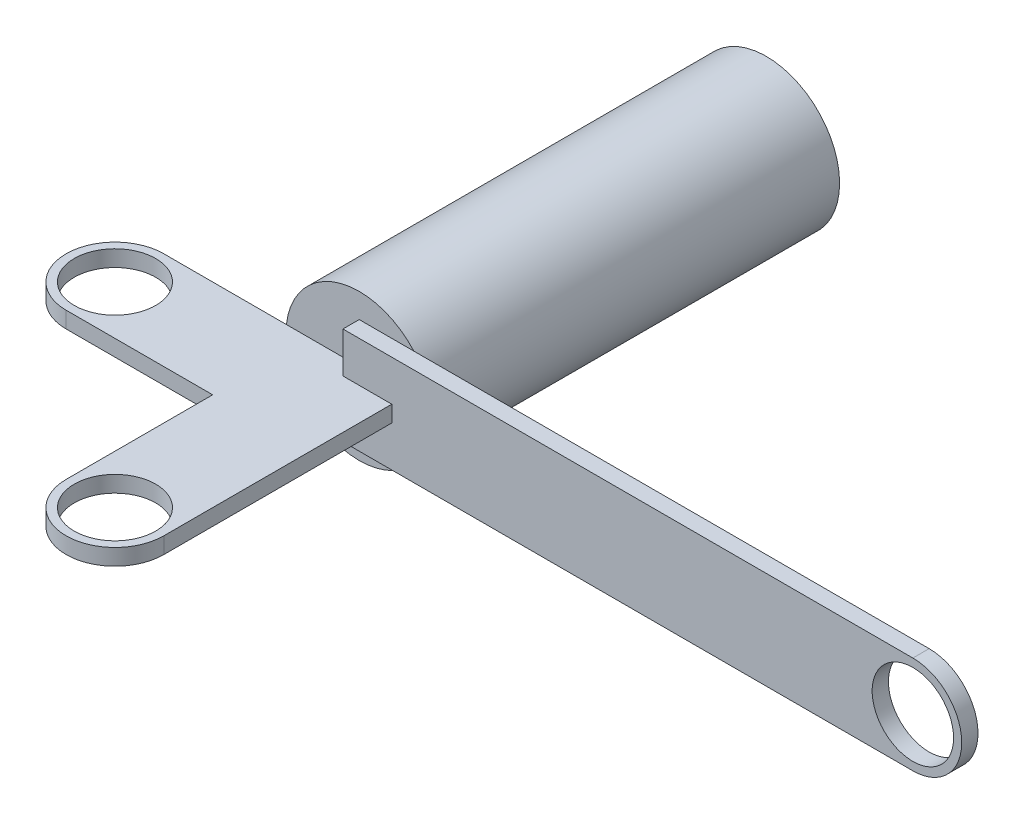
ISO-10303-21;
HEADER;
FILE_DESCRIPTION(('STEP AP214'),'2;1');
FILE_NAME('part.step','',(''),(''),'','','');
FILE_SCHEMA(('AUTOMOTIVE_DESIGN { 1 0 10303 214 1 1 1 1 }'));
ENDSEC;
DATA;
#1=APPLICATION_CONTEXT('core data for automotive mechanical design processes');
#2=APPLICATION_PROTOCOL_DEFINITION('international standard','automotive_design',2000,#1);
#3=PRODUCT_CONTEXT('',#1,'mechanical');
#4=PRODUCT('Part','Part','',(#3));
#5=PRODUCT_RELATED_PRODUCT_CATEGORY('part','',(#4));
#6=PRODUCT_DEFINITION_FORMATION('','',#4);
#7=PRODUCT_DEFINITION_CONTEXT('part definition',#1,'design');
#8=PRODUCT_DEFINITION('design','',#6,#7);
#9=PRODUCT_DEFINITION_SHAPE('','',#8);
#10=(LENGTH_UNIT() NAMED_UNIT(*) SI_UNIT(.MILLI.,.METRE.));
#11=(NAMED_UNIT(*) PLANE_ANGLE_UNIT() SI_UNIT($,.RADIAN.));
#12=(NAMED_UNIT(*) SI_UNIT($,.STERADIAN.) SOLID_ANGLE_UNIT());
#13=UNCERTAINTY_MEASURE_WITH_UNIT(LENGTH_MEASURE(1.E-05),#10,'distance_accuracy_value','');
#14=(GEOMETRIC_REPRESENTATION_CONTEXT(3) GLOBAL_UNCERTAINTY_ASSIGNED_CONTEXT((#13)) GLOBAL_UNIT_ASSIGNED_CONTEXT((#10,
#11,#12)) REPRESENTATION_CONTEXT('',''));
#15=CARTESIAN_POINT('',(0.,0.,0.));
#16=DIRECTION('',(0.,0.,1.));
#17=DIRECTION('',(1.,0.,0.));
#18=AXIS2_PLACEMENT_3D('',#15,#16,#17);
#19=CARTESIAN_POINT('',(0.,0.,0.));
#20=DIRECTION('',(0.,0.,1.));
#21=DIRECTION('',(1.,0.,0.));
#22=AXIS2_PLACEMENT_3D('',#19,#20,#21);
#23=PLANE('',#22);
#24=CARTESIAN_POINT('',(0.,0.,0.));
#25=DIRECTION('',(0.,0.,1.));
#26=DIRECTION('',(1.,0.,0.));
#27=AXIS2_PLACEMENT_3D('',#24,#25,#26);
#28=CIRCLE('',#27,9.);
#29=CARTESIAN_POINT('',(-8.94427190999916,-1.,0.));
#30=VERTEX_POINT('',#29);
#31=CARTESIAN_POINT('',(6.70820393249937,-6.,0.));
#32=VERTEX_POINT('',#31);
#33=EDGE_CURVE('E240',#30,#32,#28,.T.);
#34=ORIENTED_EDGE('',*,*,#33,.T.);
#35=DIRECTION('',(1.,0.,0.));
#36=VECTOR('',#35,1.);
#37=CARTESIAN_POINT('',(0.,-6.,0.));
#38=LINE('',#37,#36);
#39=CARTESIAN_POINT('',(0.,-6.,0.));
#40=VERTEX_POINT('',#39);
#41=EDGE_CURVE('E52',#40,#32,#38,.T.);
#42=ORIENTED_EDGE('',*,*,#41,.F.);
#43=DIRECTION('',(0.,-1.,0.));
#44=VECTOR('',#43,1.);
#45=CARTESIAN_POINT('',(0.,0.,0.));
#46=LINE('',#45,#44);
#47=CARTESIAN_POINT('',(0.,-1.,0.));
#48=VERTEX_POINT('',#47);
#49=EDGE_CURVE('E163',#48,#40,#46,.T.);
#50=ORIENTED_EDGE('',*,*,#49,.F.);
#51=DIRECTION('',(-1.,0.,0.));
#52=VECTOR('',#51,1.);
#53=CARTESIAN_POINT('',(0.,-1.,0.));
#54=LINE('',#53,#52);
#55=EDGE_CURVE('E236',#48,#30,#54,.T.);
#56=ORIENTED_EDGE('',*,*,#55,.T.);
#57=EDGE_LOOP('',(#34,#42,#50,#56));
#58=FACE_BOUND('',#57,.T.);
#59=ADVANCED_FACE('F37',(#58),#23,.T.);
#60=CARTESIAN_POINT('',(0.,6.,0.));
#61=VERTEX_POINT('',#60);
#62=CARTESIAN_POINT('',(0.,1.,0.));
#63=VERTEX_POINT('',#62);
#64=EDGE_CURVE('E60',#61,#63,#46,.T.);
#65=ORIENTED_EDGE('',*,*,#64,.F.);
#66=DIRECTION('',(-1.,0.,0.));
#67=VECTOR('',#66,1.);
#68=CARTESIAN_POINT('',(0.,6.,0.));
#69=LINE('',#68,#67);
#70=CARTESIAN_POINT('',(6.70820393249937,6.,0.));
#71=VERTEX_POINT('',#70);
#72=EDGE_CURVE('E253',#71,#61,#69,.T.);
#73=ORIENTED_EDGE('',*,*,#72,.F.);
#74=CARTESIAN_POINT('',(-8.94427190999916,1.,0.));
#75=VERTEX_POINT('',#74);
#76=EDGE_CURVE('E232',#71,#75,#28,.T.);
#77=ORIENTED_EDGE('',*,*,#76,.T.);
#78=DIRECTION('',(-1.,0.,0.));
#79=VECTOR('',#78,1.);
#80=CARTESIAN_POINT('',(0.,1.,0.));
#81=LINE('',#80,#79);
#82=EDGE_CURVE('E242',#63,#75,#81,.T.);
#83=ORIENTED_EDGE('',*,*,#82,.F.);
#84=EDGE_LOOP('',(#65,#73,#77,#83));
#85=FACE_BOUND('',#84,.T.);
#86=ADVANCED_FACE('F281',(#85),#23,.T.);
#87=CARTESIAN_POINT('',(0.,0.,-50.));
#88=DIRECTION('',(0.,0.,1.));
#89=DIRECTION('',(1.,0.,0.));
#90=AXIS2_PLACEMENT_3D('',#87,#88,#89);
#91=CYLINDRICAL_SURFACE('',#90,9.);
#92=CARTESIAN_POINT('',(0.,0.,-50.));
#93=DIRECTION('',(0.,0.,1.));
#94=DIRECTION('',(1.,0.,0.));
#95=AXIS2_PLACEMENT_3D('',#92,#93,#94);
#96=CIRCLE('',#95,9.);
#97=CARTESIAN_POINT('',(9.,0.,-50.));
#98=VERTEX_POINT('',#97);
#99=EDGE_CURVE('E233',#98,#98,#96,.T.);
#100=ORIENTED_EDGE('',*,*,#99,.T.);
#101=EDGE_LOOP('',(#100));
#102=FACE_BOUND('',#101,.T.);
#103=EDGE_CURVE('E237',#75,#30,#28,.T.);
#104=ORIENTED_EDGE('',*,*,#103,.F.);
#105=ORIENTED_EDGE('',*,*,#76,.F.);
#106=CARTESIAN_POINT('',(0.,0.,0.));
#107=DIRECTION('',(0.,0.,1.));
#108=DIRECTION('',(1.,0.,0.));
#109=AXIS2_PLACEMENT_3D('',#106,#107,#108);
#110=CIRCLE('',#109,9.);
#111=EDGE_CURVE('E166',#71,#32,#110,.F.);
#112=ORIENTED_EDGE('',*,*,#111,.T.);
#113=ORIENTED_EDGE('',*,*,#33,.F.);
#114=EDGE_LOOP('',(#104,#105,#112,#113));
#115=FACE_BOUND('',#114,.T.);
#116=ADVANCED_FACE('F39',(#102,#115),#91,.T.);
#117=CARTESIAN_POINT('',(0.,0.,-50.));
#118=DIRECTION('',(0.,0.,1.));
#119=DIRECTION('',(1.,0.,0.));
#120=AXIS2_PLACEMENT_3D('',#117,#118,#119);
#121=PLANE('',#120);
#122=ORIENTED_EDGE('',*,*,#99,.F.);
#123=EDGE_LOOP('',(#122));
#124=FACE_BOUND('',#123,.T.);
#125=ADVANCED_FACE('F336',(#124),#121,.F.);
#126=CARTESIAN_POINT('',(0.,1.,0.));
#127=DIRECTION('',(0.,0.,-1.));
#128=DIRECTION('',(-1.,0.,0.));
#129=AXIS2_PLACEMENT_3D('',#126,#127,#128);
#130=PLANE('',#129);
#131=DIRECTION('',(1.,0.,0.));
#132=VECTOR('',#131,1.);
#133=CARTESIAN_POINT('',(0.,1.,0.));
#134=LINE('',#133,#132);
#135=CARTESIAN_POINT('',(-24.,1.,0.));
#136=VERTEX_POINT('',#135);
#137=EDGE_CURVE('E179',#136,#75,#134,.T.);
#138=ORIENTED_EDGE('',*,*,#137,.T.);
#139=ORIENTED_EDGE('',*,*,#103,.T.);
#140=DIRECTION('',(1.,0.,0.));
#141=VECTOR('',#140,1.);
#142=CARTESIAN_POINT('',(0.,-1.,0.));
#143=LINE('',#142,#141);
#144=CARTESIAN_POINT('',(-24.,-1.,0.));
#145=VERTEX_POINT('',#144);
#146=EDGE_CURVE('E178',#145,#30,#143,.T.);
#147=ORIENTED_EDGE('',*,*,#146,.F.);
#148=DIRECTION('',(0.,-1.,0.));
#149=VECTOR('',#148,1.);
#150=CARTESIAN_POINT('',(-24.,1.,0.));
#151=LINE('',#150,#149);
#152=EDGE_CURVE('E230',#136,#145,#151,.T.);
#153=ORIENTED_EDGE('',*,*,#152,.F.);
#154=EDGE_LOOP('',(#138,#139,#147,#153));
#155=FACE_BOUND('',#154,.T.);
#156=ADVANCED_FACE('F288',(#155),#130,.T.);
#157=CARTESIAN_POINT('',(-24.,1.,6.));
#158=DIRECTION('',(0.,-1.,0.));
#159=DIRECTION('',(0.,0.,-1.));
#160=AXIS2_PLACEMENT_3D('',#157,#158,#159);
#161=CYLINDRICAL_SURFACE('',#160,6.);
#162=CARTESIAN_POINT('',(-24.,-1.,6.));
#163=DIRECTION('',(0.,1.,0.));
#164=DIRECTION('',(0.,0.,1.));
#165=AXIS2_PLACEMENT_3D('',#162,#163,#164);
#166=CIRCLE('',#165,6.);
#167=CARTESIAN_POINT('',(-24.,-1.,12.));
#168=VERTEX_POINT('',#167);
#169=EDGE_CURVE('E203',#145,#168,#166,.T.);
#170=ORIENTED_EDGE('',*,*,#169,.T.);
#171=DIRECTION('',(0.,-1.,0.));
#172=VECTOR('',#171,1.);
#173=CARTESIAN_POINT('',(-24.,1.,12.));
#174=LINE('',#173,#172);
#175=CARTESIAN_POINT('',(-24.,1.,12.));
#176=VERTEX_POINT('',#175);
#177=EDGE_CURVE('E227',#176,#168,#174,.T.);
#178=ORIENTED_EDGE('',*,*,#177,.F.);
#179=CARTESIAN_POINT('',(-24.,1.,6.));
#180=DIRECTION('',(0.,1.,0.));
#181=DIRECTION('',(0.,0.,1.));
#182=AXIS2_PLACEMENT_3D('',#179,#180,#181);
#183=CIRCLE('',#182,6.);
#184=EDGE_CURVE('E182',#136,#176,#183,.T.);
#185=ORIENTED_EDGE('',*,*,#184,.F.);
#186=ORIENTED_EDGE('',*,*,#152,.T.);
#187=EDGE_LOOP('',(#170,#178,#185,#186));
#188=FACE_BOUND('',#187,.T.);
#189=ADVANCED_FACE('F292',(#188),#161,.T.);
#190=CARTESIAN_POINT('',(0.,1.,12.));
#191=DIRECTION('',(0.,0.,-1.));
#192=DIRECTION('',(-1.,0.,0.));
#193=AXIS2_PLACEMENT_3D('',#190,#191,#192);
#194=PLANE('',#193);
#195=DIRECTION('',(1.,0.,0.));
#196=VECTOR('',#195,1.);
#197=CARTESIAN_POINT('',(0.,-1.,12.));
#198=LINE('',#197,#196);
#199=CARTESIAN_POINT('',(-6.,-1.,12.));
#200=VERTEX_POINT('',#199);
#201=EDGE_CURVE('E205',#168,#200,#198,.T.);
#202=ORIENTED_EDGE('',*,*,#201,.T.);
#203=DIRECTION('',(0.,-1.,0.));
#204=VECTOR('',#203,1.);
#205=CARTESIAN_POINT('',(-6.,1.,12.));
#206=LINE('',#205,#204);
#207=CARTESIAN_POINT('',(-6.,1.,12.));
#208=VERTEX_POINT('',#207);
#209=EDGE_CURVE('E224',#208,#200,#206,.T.);
#210=ORIENTED_EDGE('',*,*,#209,.F.);
#211=DIRECTION('',(1.,0.,0.));
#212=VECTOR('',#211,1.);
#213=CARTESIAN_POINT('',(0.,1.,12.));
#214=LINE('',#213,#212);
#215=EDGE_CURVE('E185',#176,#208,#214,.T.);
#216=ORIENTED_EDGE('',*,*,#215,.F.);
#217=ORIENTED_EDGE('',*,*,#177,.T.);
#218=EDGE_LOOP('',(#202,#210,#216,#217));
#219=FACE_BOUND('',#218,.T.);
#220=ADVANCED_FACE('F299',(#219),#194,.F.);
#221=CARTESIAN_POINT('',(-6.,1.,0.));
#222=DIRECTION('',(1.,0.,0.));
#223=DIRECTION('',(0.,0.,-1.));
#224=AXIS2_PLACEMENT_3D('',#221,#222,#223);
#225=PLANE('',#224);
#226=DIRECTION('',(0.,0.,1.));
#227=VECTOR('',#226,1.);
#228=CARTESIAN_POINT('',(-6.,-1.,0.));
#229=LINE('',#228,#227);
#230=CARTESIAN_POINT('',(-6.,-1.,30.));
#231=VERTEX_POINT('',#230);
#232=EDGE_CURVE('E207',#200,#231,#229,.T.);
#233=ORIENTED_EDGE('',*,*,#232,.T.);
#234=DIRECTION('',(0.,-1.,0.));
#235=VECTOR('',#234,1.);
#236=CARTESIAN_POINT('',(-6.,1.,30.));
#237=LINE('',#236,#235);
#238=CARTESIAN_POINT('',(-6.,1.,30.));
#239=VERTEX_POINT('',#238);
#240=EDGE_CURVE('E222',#239,#231,#237,.T.);
#241=ORIENTED_EDGE('',*,*,#240,.F.);
#242=DIRECTION('',(0.,0.,1.));
#243=VECTOR('',#242,1.);
#244=CARTESIAN_POINT('',(-6.,1.,0.));
#245=LINE('',#244,#243);
#246=EDGE_CURVE('E187',#208,#239,#245,.T.);
#247=ORIENTED_EDGE('',*,*,#246,.F.);
#248=ORIENTED_EDGE('',*,*,#209,.T.);
#249=EDGE_LOOP('',(#233,#241,#247,#248));
#250=FACE_BOUND('',#249,.T.);
#251=ADVANCED_FACE('F303',(#250),#225,.F.);
#252=CARTESIAN_POINT('',(0.,1.,30.));
#253=DIRECTION('',(0.,-1.,0.));
#254=DIRECTION('',(0.,0.,-1.));
#255=AXIS2_PLACEMENT_3D('',#252,#253,#254);
#256=CYLINDRICAL_SURFACE('',#255,6.);
#257=CARTESIAN_POINT('',(0.,-1.,30.));
#258=DIRECTION('',(0.,1.,0.));
#259=DIRECTION('',(0.,0.,1.));
#260=AXIS2_PLACEMENT_3D('',#257,#258,#259);
#261=CIRCLE('',#260,6.);
#262=CARTESIAN_POINT('',(6.,-1.,30.));
#263=VERTEX_POINT('',#262);
#264=EDGE_CURVE('E210',#263,#231,#261,.F.);
#265=ORIENTED_EDGE('',*,*,#264,.F.);
#266=DIRECTION('',(0.,-1.,0.));
#267=VECTOR('',#266,1.);
#268=CARTESIAN_POINT('',(6.,1.,30.));
#269=LINE('',#268,#267);
#270=CARTESIAN_POINT('',(6.,1.,30.));
#271=VERTEX_POINT('',#270);
#272=EDGE_CURVE('E200',#271,#263,#269,.T.);
#273=ORIENTED_EDGE('',*,*,#272,.F.);
#274=CARTESIAN_POINT('',(0.,1.,30.));
#275=DIRECTION('',(0.,1.,0.));
#276=DIRECTION('',(0.,0.,1.));
#277=AXIS2_PLACEMENT_3D('',#274,#275,#276);
#278=CIRCLE('',#277,6.);
#279=EDGE_CURVE('E189',#271,#239,#278,.F.);
#280=ORIENTED_EDGE('',*,*,#279,.T.);
#281=ORIENTED_EDGE('',*,*,#240,.T.);
#282=EDGE_LOOP('',(#265,#273,#280,#281));
#283=FACE_BOUND('',#282,.T.);
#284=ADVANCED_FACE('F307',(#283),#256,.T.);
#285=CARTESIAN_POINT('',(0.,1.,30.));
#286=DIRECTION('',(0.,-1.,0.));
#287=DIRECTION('',(0.,0.,-1.));
#288=AXIS2_PLACEMENT_3D('',#285,#286,#287);
#289=CYLINDRICAL_SURFACE('',#288,5.);
#290=CARTESIAN_POINT('',(0.,1.,30.));
#291=DIRECTION('',(0.,1.,0.));
#292=DIRECTION('',(0.,0.,1.));
#293=AXIS2_PLACEMENT_3D('',#290,#291,#292);
#294=CIRCLE('',#293,5.);
#295=CARTESIAN_POINT('',(0.,1.,35.));
#296=VERTEX_POINT('',#295);
#297=EDGE_CURVE('E194',#296,#296,#294,.T.);
#298=ORIENTED_EDGE('',*,*,#297,.T.);
#299=EDGE_LOOP('',(#298));
#300=FACE_BOUND('',#299,.T.);
#301=CARTESIAN_POINT('',(0.,-1.,30.));
#302=DIRECTION('',(0.,1.,0.));
#303=DIRECTION('',(0.,0.,1.));
#304=AXIS2_PLACEMENT_3D('',#301,#302,#303);
#305=CIRCLE('',#304,5.);
#306=CARTESIAN_POINT('',(0.,-1.,35.));
#307=VERTEX_POINT('',#306);
#308=EDGE_CURVE('E215',#307,#307,#305,.T.);
#309=ORIENTED_EDGE('',*,*,#308,.F.);
#310=EDGE_LOOP('',(#309));
#311=FACE_BOUND('',#310,.T.);
#312=ADVANCED_FACE('F350',(#300,#311),#289,.F.);
#313=CARTESIAN_POINT('',(6.,1.,0.));
#314=DIRECTION('',(1.,0.,0.));
#315=DIRECTION('',(0.,0.,-1.));
#316=AXIS2_PLACEMENT_3D('',#313,#314,#315);
#317=PLANE('',#316);
#318=DIRECTION('',(0.,-1.,0.));
#319=VECTOR('',#318,1.);
#320=CARTESIAN_POINT('',(6.,1.,2.));
#321=LINE('',#320,#319);
#322=CARTESIAN_POINT('',(6.,1.,2.));
#323=VERTEX_POINT('',#322);
#324=CARTESIAN_POINT('',(6.,-1.,2.));
#325=VERTEX_POINT('',#324);
#326=EDGE_CURVE('E173',#323,#325,#321,.T.);
#327=ORIENTED_EDGE('',*,*,#326,.F.);
#328=DIRECTION('',(0.,0.,1.));
#329=VECTOR('',#328,1.);
#330=CARTESIAN_POINT('',(6.,1.,0.));
#331=LINE('',#330,#329);
#332=EDGE_CURVE('E192',#323,#271,#331,.T.);
#333=ORIENTED_EDGE('',*,*,#332,.T.);
#334=ORIENTED_EDGE('',*,*,#272,.T.);
#335=DIRECTION('',(0.,0.,1.));
#336=VECTOR('',#335,1.);
#337=CARTESIAN_POINT('',(6.,-1.,0.));
#338=LINE('',#337,#336);
#339=EDGE_CURVE('E213',#325,#263,#338,.T.);
#340=ORIENTED_EDGE('',*,*,#339,.F.);
#341=EDGE_LOOP('',(#327,#333,#334,#340));
#342=FACE_BOUND('',#341,.T.);
#343=ADVANCED_FACE('F351',(#342),#317,.T.);
#344=CARTESIAN_POINT('',(-24.,1.,6.));
#345=DIRECTION('',(0.,-1.,0.));
#346=DIRECTION('',(0.,0.,-1.));
#347=AXIS2_PLACEMENT_3D('',#344,#345,#346);
#348=CYLINDRICAL_SURFACE('',#347,5.);
#349=CARTESIAN_POINT('',(-24.,1.,6.));
#350=DIRECTION('',(0.,1.,0.));
#351=DIRECTION('',(0.,0.,1.));
#352=AXIS2_PLACEMENT_3D('',#349,#350,#351);
#353=CIRCLE('',#352,5.);
#354=CARTESIAN_POINT('',(-24.,1.,11.));
#355=VERTEX_POINT('',#354);
#356=EDGE_CURVE('E197',#355,#355,#353,.T.);
#357=ORIENTED_EDGE('',*,*,#356,.T.);
#358=EDGE_LOOP('',(#357));
#359=FACE_BOUND('',#358,.T.);
#360=CARTESIAN_POINT('',(-24.,-1.,6.));
#361=DIRECTION('',(0.,1.,0.));
#362=DIRECTION('',(0.,0.,1.));
#363=AXIS2_PLACEMENT_3D('',#360,#361,#362);
#364=CIRCLE('',#363,5.);
#365=CARTESIAN_POINT('',(-24.,-1.,11.));
#366=VERTEX_POINT('',#365);
#367=EDGE_CURVE('E183',#366,#366,#364,.T.);
#368=ORIENTED_EDGE('',*,*,#367,.F.);
#369=EDGE_LOOP('',(#368));
#370=FACE_BOUND('',#369,.T.);
#371=ADVANCED_FACE('F354',(#359,#370),#348,.F.);
#372=CARTESIAN_POINT('',(0.,1.,0.));
#373=DIRECTION('',(0.,1.,0.));
#374=DIRECTION('',(0.,0.,1.));
#375=AXIS2_PLACEMENT_3D('',#372,#373,#374);
#376=PLANE('',#375);
#377=DIRECTION('',(1.,0.,0.));
#378=VECTOR('',#377,1.);
#379=CARTESIAN_POINT('',(0.,1.,2.));
#380=LINE('',#379,#378);
#381=CARTESIAN_POINT('',(0.,1.,2.));
#382=VERTEX_POINT('',#381);
#383=EDGE_CURVE('E175',#382,#323,#380,.T.);
#384=ORIENTED_EDGE('',*,*,#383,.F.);
#385=DIRECTION('',(0.,0.,-1.));
#386=VECTOR('',#385,1.);
#387=CARTESIAN_POINT('',(0.,1.,0.));
#388=LINE('',#387,#386);
#389=EDGE_CURVE('E164',#382,#63,#388,.T.);
#390=ORIENTED_EDGE('',*,*,#389,.T.);
#391=ORIENTED_EDGE('',*,*,#82,.T.);
#392=ORIENTED_EDGE('',*,*,#137,.F.);
#393=ORIENTED_EDGE('',*,*,#184,.T.);
#394=ORIENTED_EDGE('',*,*,#215,.T.);
#395=ORIENTED_EDGE('',*,*,#246,.T.);
#396=ORIENTED_EDGE('',*,*,#279,.F.);
#397=ORIENTED_EDGE('',*,*,#332,.F.);
#398=EDGE_LOOP('',(#384,#390,#391,#392,#393,#394,#395,#396,#397));
#399=FACE_BOUND('',#398,.T.);
#400=ORIENTED_EDGE('',*,*,#297,.F.);
#401=EDGE_LOOP('',(#400));
#402=FACE_BOUND('',#401,.T.);
#403=ORIENTED_EDGE('',*,*,#356,.F.);
#404=EDGE_LOOP('',(#403));
#405=FACE_BOUND('',#404,.T.);
#406=ADVANCED_FACE('F284',(#399,#402,#405),#376,.T.);
#407=CARTESIAN_POINT('',(0.,-1.,0.));
#408=DIRECTION('',(0.,1.,0.));
#409=DIRECTION('',(0.,0.,1.));
#410=AXIS2_PLACEMENT_3D('',#407,#408,#409);
#411=PLANE('',#410);
#412=DIRECTION('',(0.,0.,-1.));
#413=VECTOR('',#412,1.);
#414=CARTESIAN_POINT('',(0.,-1.,0.));
#415=LINE('',#414,#413);
#416=CARTESIAN_POINT('',(0.,-1.,2.));
#417=VERTEX_POINT('',#416);
#418=EDGE_CURVE('E45',#417,#48,#415,.T.);
#419=ORIENTED_EDGE('',*,*,#418,.F.);
#420=DIRECTION('',(1.,0.,0.));
#421=VECTOR('',#420,1.);
#422=CARTESIAN_POINT('',(0.,-1.,2.));
#423=LINE('',#422,#421);
#424=EDGE_CURVE('E11',#417,#325,#423,.T.);
#425=ORIENTED_EDGE('',*,*,#424,.T.);
#426=ORIENTED_EDGE('',*,*,#339,.T.);
#427=ORIENTED_EDGE('',*,*,#264,.T.);
#428=ORIENTED_EDGE('',*,*,#232,.F.);
#429=ORIENTED_EDGE('',*,*,#201,.F.);
#430=ORIENTED_EDGE('',*,*,#169,.F.);
#431=ORIENTED_EDGE('',*,*,#146,.T.);
#432=ORIENTED_EDGE('',*,*,#55,.F.);
#433=EDGE_LOOP('',(#419,#425,#426,#427,#428,#429,#430,#431,#432));
#434=FACE_BOUND('',#433,.T.);
#435=ORIENTED_EDGE('',*,*,#308,.T.);
#436=EDGE_LOOP('',(#435));
#437=FACE_BOUND('',#436,.T.);
#438=ORIENTED_EDGE('',*,*,#367,.T.);
#439=EDGE_LOOP('',(#438));
#440=FACE_BOUND('',#439,.T.);
#441=ADVANCED_FACE('F245',(#434,#437,#440),#411,.F.);
#442=CARTESIAN_POINT('',(0.,0.,2.));
#443=DIRECTION('',(1.,0.,0.));
#444=DIRECTION('',(0.,1.,0.));
#445=AXIS2_PLACEMENT_3D('',#442,#443,#444);
#446=PLANE('',#445);
#447=DIRECTION('',(0.,-1.,0.));
#448=VECTOR('',#447,1.);
#449=CARTESIAN_POINT('',(0.,0.,2.));
#450=LINE('',#449,#448);
#451=CARTESIAN_POINT('',(0.,-6.,2.));
#452=VERTEX_POINT('',#451);
#453=EDGE_CURVE('E140',#417,#452,#450,.T.);
#454=ORIENTED_EDGE('',*,*,#453,.F.);
#455=ORIENTED_EDGE('',*,*,#418,.T.);
#456=ORIENTED_EDGE('',*,*,#49,.T.);
#457=DIRECTION('',(0.,0.,-1.));
#458=VECTOR('',#457,1.);
#459=CARTESIAN_POINT('',(0.,-6.,2.));
#460=LINE('',#459,#458);
#461=EDGE_CURVE('E156',#452,#40,#460,.T.);
#462=ORIENTED_EDGE('',*,*,#461,.F.);
#463=EDGE_LOOP('',(#454,#455,#456,#462));
#464=FACE_BOUND('',#463,.T.);
#465=ADVANCED_FACE('F162',(#464),#446,.F.);
#466=CARTESIAN_POINT('',(70.,0.,2.));
#467=DIRECTION('',(0.,0.,1.));
#468=DIRECTION('',(1.,0.,0.));
#469=AXIS2_PLACEMENT_3D('',#466,#467,#468);
#470=PLANE('',#469);
#471=CARTESIAN_POINT('',(0.,6.,2.));
#472=VERTEX_POINT('',#471);
#473=EDGE_CURVE('E151',#472,#382,#450,.T.);
#474=ORIENTED_EDGE('',*,*,#473,.T.);
#475=ORIENTED_EDGE('',*,*,#383,.T.);
#476=ORIENTED_EDGE('',*,*,#326,.T.);
#477=ORIENTED_EDGE('',*,*,#424,.F.);
#478=ORIENTED_EDGE('',*,*,#453,.T.);
#479=DIRECTION('',(1.,0.,0.));
#480=VECTOR('',#479,1.);
#481=CARTESIAN_POINT('',(0.,-6.,2.));
#482=LINE('',#481,#480);
#483=CARTESIAN_POINT('',(70.,-6.,2.));
#484=VERTEX_POINT('',#483);
#485=EDGE_CURVE('E145',#452,#484,#482,.T.);
#486=ORIENTED_EDGE('',*,*,#485,.T.);
#487=CARTESIAN_POINT('',(70.,0.,2.));
#488=DIRECTION('',(0.,0.,1.));
#489=DIRECTION('',(1.,0.,0.));
#490=AXIS2_PLACEMENT_3D('',#487,#488,#489);
#491=CIRCLE('',#490,6.);
#492=CARTESIAN_POINT('',(70.,6.,2.));
#493=VERTEX_POINT('',#492);
#494=EDGE_CURVE('E160',#484,#493,#491,.T.);
#495=ORIENTED_EDGE('',*,*,#494,.T.);
#496=DIRECTION('',(-1.,0.,0.));
#497=VECTOR('',#496,1.);
#498=CARTESIAN_POINT('',(0.,6.,2.));
#499=LINE('',#498,#497);
#500=EDGE_CURVE('E259',#493,#472,#499,.T.);
#501=ORIENTED_EDGE('',*,*,#500,.T.);
#502=EDGE_LOOP('',(#474,#475,#476,#477,#478,#486,#495,#501));
#503=FACE_BOUND('',#502,.T.);
#504=CARTESIAN_POINT('',(70.,0.,2.));
#505=DIRECTION('',(0.,0.,1.));
#506=DIRECTION('',(1.,0.,0.));
#507=AXIS2_PLACEMENT_3D('',#504,#505,#506);
#508=CIRCLE('',#507,5.);
#509=CARTESIAN_POINT('',(75.,0.,2.));
#510=VERTEX_POINT('',#509);
#511=EDGE_CURVE('E537',#510,#510,#508,.T.);
#512=ORIENTED_EDGE('',*,*,#511,.F.);
#513=EDGE_LOOP('',(#512));
#514=FACE_BOUND('',#513,.T.);
#515=ADVANCED_FACE('F143',(#503,#514),#470,.T.);
#516=CARTESIAN_POINT('',(70.,0.,0.));
#517=DIRECTION('',(0.,0.,1.));
#518=DIRECTION('',(1.,0.,0.));
#519=AXIS2_PLACEMENT_3D('',#516,#517,#518);
#520=PLANE('',#519);
#521=ORIENTED_EDGE('',*,*,#111,.F.);
#522=CARTESIAN_POINT('',(70.,6.,0.));
#523=VERTEX_POINT('',#522);
#524=EDGE_CURVE('E250',#523,#71,#69,.T.);
#525=ORIENTED_EDGE('',*,*,#524,.F.);
#526=CARTESIAN_POINT('',(70.,0.,0.));
#527=DIRECTION('',(0.,0.,1.));
#528=DIRECTION('',(1.,0.,0.));
#529=AXIS2_PLACEMENT_3D('',#526,#527,#528);
#530=CIRCLE('',#529,6.);
#531=CARTESIAN_POINT('',(70.,-6.,0.));
#532=VERTEX_POINT('',#531);
#533=EDGE_CURVE('E275',#532,#523,#530,.T.);
#534=ORIENTED_EDGE('',*,*,#533,.F.);
#535=EDGE_CURVE('E276',#32,#532,#38,.T.);
#536=ORIENTED_EDGE('',*,*,#535,.F.);
#537=EDGE_LOOP('',(#521,#525,#534,#536));
#538=FACE_BOUND('',#537,.T.);
#539=CARTESIAN_POINT('',(70.,0.,0.));
#540=DIRECTION('',(0.,0.,1.));
#541=DIRECTION('',(1.,0.,0.));
#542=AXIS2_PLACEMENT_3D('',#539,#540,#541);
#543=CIRCLE('',#542,5.);
#544=CARTESIAN_POINT('',(75.,0.,0.));
#545=VERTEX_POINT('',#544);
#546=EDGE_CURVE('E312',#545,#545,#543,.T.);
#547=ORIENTED_EDGE('',*,*,#546,.T.);
#548=EDGE_LOOP('',(#547));
#549=FACE_BOUND('',#548,.T.);
#550=ADVANCED_FACE('F272',(#538,#549),#520,.F.);
#551=CARTESIAN_POINT('',(0.,-6.,2.));
#552=DIRECTION('',(0.,1.,0.));
#553=DIRECTION('',(0.,0.,1.));
#554=AXIS2_PLACEMENT_3D('',#551,#552,#553);
#555=PLANE('',#554);
#556=ORIENTED_EDGE('',*,*,#41,.T.);
#557=ORIENTED_EDGE('',*,*,#535,.T.);
#558=DIRECTION('',(0.,0.,-1.));
#559=VECTOR('',#558,1.);
#560=CARTESIAN_POINT('',(70.,-6.,2.));
#561=LINE('',#560,#559);
#562=EDGE_CURVE('E158',#484,#532,#561,.T.);
#563=ORIENTED_EDGE('',*,*,#562,.F.);
#564=ORIENTED_EDGE('',*,*,#485,.F.);
#565=ORIENTED_EDGE('',*,*,#461,.T.);
#566=EDGE_LOOP('',(#556,#557,#563,#564,#565));
#567=FACE_BOUND('',#566,.T.);
#568=ADVANCED_FACE('F155',(#567),#555,.F.);
#569=CARTESIAN_POINT('',(70.,0.,2.));
#570=DIRECTION('',(0.,0.,-1.));
#571=DIRECTION('',(-1.,0.,0.));
#572=AXIS2_PLACEMENT_3D('',#569,#570,#571);
#573=CYLINDRICAL_SURFACE('',#572,6.);
#574=ORIENTED_EDGE('',*,*,#533,.T.);
#575=DIRECTION('',(0.,0.,-1.));
#576=VECTOR('',#575,1.);
#577=CARTESIAN_POINT('',(70.,6.,2.));
#578=LINE('',#577,#576);
#579=EDGE_CURVE('E168',#493,#523,#578,.T.);
#580=ORIENTED_EDGE('',*,*,#579,.F.);
#581=ORIENTED_EDGE('',*,*,#494,.F.);
#582=ORIENTED_EDGE('',*,*,#562,.T.);
#583=EDGE_LOOP('',(#574,#580,#581,#582));
#584=FACE_BOUND('',#583,.T.);
#585=ADVANCED_FACE('F327',(#584),#573,.T.);
#586=CARTESIAN_POINT('',(0.,6.,2.));
#587=DIRECTION('',(0.,-1.,0.));
#588=DIRECTION('',(0.,0.,-1.));
#589=AXIS2_PLACEMENT_3D('',#586,#587,#588);
#590=PLANE('',#589);
#591=ORIENTED_EDGE('',*,*,#524,.T.);
#592=ORIENTED_EDGE('',*,*,#72,.T.);
#593=DIRECTION('',(0.,0.,-1.));
#594=VECTOR('',#593,1.);
#595=CARTESIAN_POINT('',(0.,6.,2.));
#596=LINE('',#595,#594);
#597=EDGE_CURVE('E257',#472,#61,#596,.T.);
#598=ORIENTED_EDGE('',*,*,#597,.F.);
#599=ORIENTED_EDGE('',*,*,#500,.F.);
#600=ORIENTED_EDGE('',*,*,#579,.T.);
#601=EDGE_LOOP('',(#591,#592,#598,#599,#600));
#602=FACE_BOUND('',#601,.T.);
#603=ADVANCED_FACE('F265',(#602),#590,.F.);
#604=ORIENTED_EDGE('',*,*,#389,.F.);
#605=ORIENTED_EDGE('',*,*,#473,.F.);
#606=ORIENTED_EDGE('',*,*,#597,.T.);
#607=ORIENTED_EDGE('',*,*,#64,.T.);
#608=EDGE_LOOP('',(#604,#605,#606,#607));
#609=FACE_BOUND('',#608,.T.);
#610=ADVANCED_FACE('F317',(#609),#446,.F.);
#611=CARTESIAN_POINT('',(70.,0.,2.));
#612=DIRECTION('',(0.,0.,-1.));
#613=DIRECTION('',(-1.,0.,0.));
#614=AXIS2_PLACEMENT_3D('',#611,#612,#613);
#615=CYLINDRICAL_SURFACE('',#614,5.);
#616=ORIENTED_EDGE('',*,*,#511,.T.);
#617=EDGE_LOOP('',(#616));
#618=FACE_BOUND('',#617,.T.);
#619=ORIENTED_EDGE('',*,*,#546,.F.);
#620=EDGE_LOOP('',(#619));
#621=FACE_BOUND('',#620,.T.);
#622=ADVANCED_FACE('F319',(#618,#621),#615,.F.);
#623=CLOSED_SHELL('',(#59,#86,#116,#125,#156,#189,#220,#251,#284,#312,#343,#371,#406,#441,#465,
#515,#550,#568,#585,#603,#610,#622));
#624=MANIFOLD_SOLID_BREP('B2',#623);
#625=ADVANCED_BREP_SHAPE_REPRESENTATION('',(#18,#624),#14);
#626=SHAPE_DEFINITION_REPRESENTATION(#9,#625);
ENDSEC;
END-ISO-10303-21;
